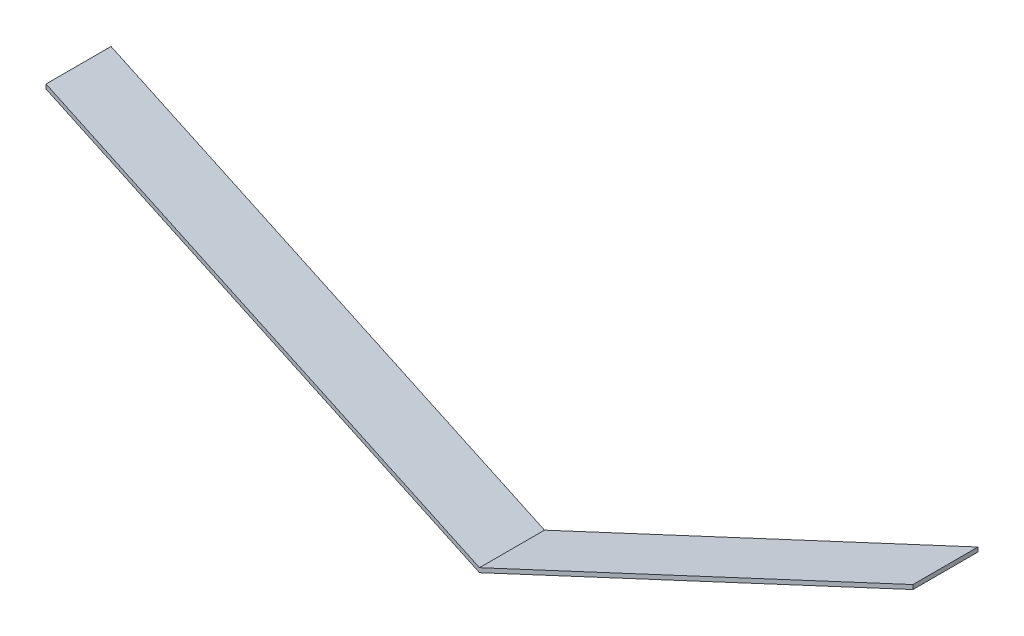
ISO-10303-21;
HEADER;
FILE_DESCRIPTION(('STEP AP214'),'2;1');
FILE_NAME('part.step','',(''),(''),'','','');
FILE_SCHEMA(('AUTOMOTIVE_DESIGN { 1 0 10303 214 1 1 1 1 }'));
ENDSEC;
DATA;
#1=APPLICATION_CONTEXT('core data for automotive mechanical design processes');
#2=APPLICATION_PROTOCOL_DEFINITION('international standard','automotive_design',2000,#1);
#3=PRODUCT_CONTEXT('',#1,'mechanical');
#4=PRODUCT('Part','Part','',(#3));
#5=PRODUCT_RELATED_PRODUCT_CATEGORY('part','',(#4));
#6=PRODUCT_DEFINITION_FORMATION('','',#4);
#7=PRODUCT_DEFINITION_CONTEXT('part definition',#1,'design');
#8=PRODUCT_DEFINITION('design','',#6,#7);
#9=PRODUCT_DEFINITION_SHAPE('','',#8);
#10=(LENGTH_UNIT() NAMED_UNIT(*) SI_UNIT(.MILLI.,.METRE.));
#11=(NAMED_UNIT(*) PLANE_ANGLE_UNIT() SI_UNIT($,.RADIAN.));
#12=(NAMED_UNIT(*) SI_UNIT($,.STERADIAN.) SOLID_ANGLE_UNIT());
#13=UNCERTAINTY_MEASURE_WITH_UNIT(LENGTH_MEASURE(1.E-05),#10,'distance_accuracy_value','');
#14=(GEOMETRIC_REPRESENTATION_CONTEXT(3) GLOBAL_UNCERTAINTY_ASSIGNED_CONTEXT((#13)) GLOBAL_UNIT_ASSIGNED_CONTEXT((#10,
#11,#12)) REPRESENTATION_CONTEXT('',''));
#15=CARTESIAN_POINT('',(0.,0.,0.));
#16=DIRECTION('',(0.,0.,1.));
#17=DIRECTION('',(1.,0.,0.));
#18=AXIS2_PLACEMENT_3D('',#15,#16,#17);
#19=CARTESIAN_POINT('',(-200.,95.2615316309993,30.));
#20=DIRECTION('',(1.,0.,0.));
#21=DIRECTION('',(0.,1.,0.));
#22=AXIS2_PLACEMENT_3D('',#19,#20,#21);
#23=PLANE('',#22);
#24=DIRECTION('',(0.,-1.,0.));
#25=VECTOR('',#24,1.);
#26=CARTESIAN_POINT('',(-200.,95.2615316309993,0.));
#27=LINE('',#26,#25);
#28=CARTESIAN_POINT('',(-200.,95.2615316309993,0.));
#29=VERTEX_POINT('',#28);
#30=CARTESIAN_POINT('',(-200.,93.2615316309993,0.));
#31=VERTEX_POINT('',#30);
#32=EDGE_CURVE('E118',#29,#31,#27,.T.);
#33=ORIENTED_EDGE('',*,*,#32,.T.);
#34=DIRECTION('',(0.,0.,-1.));
#35=VECTOR('',#34,1.);
#36=CARTESIAN_POINT('',(-200.,93.2615316309993,30.));
#37=LINE('',#36,#35);
#38=CARTESIAN_POINT('',(-200.,93.2615316309993,30.));
#39=VERTEX_POINT('',#38);
#40=EDGE_CURVE('E11',#39,#31,#37,.T.);
#41=ORIENTED_EDGE('',*,*,#40,.F.);
#42=DIRECTION('',(0.,-1.,0.));
#43=VECTOR('',#42,1.);
#44=CARTESIAN_POINT('',(-200.,95.2615316309993,30.));
#45=LINE('',#44,#43);
#46=CARTESIAN_POINT('',(-200.,95.2615316309993,30.));
#47=VERTEX_POINT('',#46);
#48=EDGE_CURVE('E130',#47,#39,#45,.T.);
#49=ORIENTED_EDGE('',*,*,#48,.F.);
#50=DIRECTION('',(0.,0.,-1.));
#51=VECTOR('',#50,1.);
#52=CARTESIAN_POINT('',(-200.,95.2615316309993,30.));
#53=LINE('',#52,#51);
#54=EDGE_CURVE('E49',#47,#29,#53,.T.);
#55=ORIENTED_EDGE('',*,*,#54,.T.);
#56=EDGE_LOOP('',(#33,#41,#49,#55));
#57=FACE_BOUND('',#56,.T.);
#58=ADVANCED_FACE('F33',(#57),#23,.F.);
#59=CARTESIAN_POINT('',(-200.,93.2615316309993,30.));
#60=DIRECTION('',(0.422618261740697,0.906307787036651,0.));
#61=DIRECTION('',(-0.906307787036651,0.422618261740697,0.));
#62=AXIS2_PLACEMENT_3D('',#59,#60,#61);
#63=PLANE('',#62);
#64=DIRECTION('',(0.906307787036651,-0.422618261740697,0.));
#65=VECTOR('',#64,1.);
#66=CARTESIAN_POINT('',(-200.,93.2615316309993,0.));
#67=LINE('',#66,#65);
#68=CARTESIAN_POINT('',(0.,0.,0.));
#69=VERTEX_POINT('',#68);
#70=EDGE_CURVE('E120',#31,#69,#67,.T.);
#71=ORIENTED_EDGE('',*,*,#70,.T.);
#72=DIRECTION('',(0.,0.,-1.));
#73=VECTOR('',#72,1.);
#74=CARTESIAN_POINT('',(0.,0.,30.));
#75=LINE('',#74,#73);
#76=CARTESIAN_POINT('',(0.,0.,30.));
#77=VERTEX_POINT('',#76);
#78=EDGE_CURVE('E41',#77,#69,#75,.T.);
#79=ORIENTED_EDGE('',*,*,#78,.F.);
#80=DIRECTION('',(0.906307787036651,-0.422618261740697,0.));
#81=VECTOR('',#80,1.);
#82=CARTESIAN_POINT('',(-200.,93.2615316309993,30.));
#83=LINE('',#82,#81);
#84=EDGE_CURVE('E81',#39,#77,#83,.T.);
#85=ORIENTED_EDGE('',*,*,#84,.F.);
#86=ORIENTED_EDGE('',*,*,#40,.T.);
#87=EDGE_LOOP('',(#71,#79,#85,#86));
#88=FACE_BOUND('',#87,.T.);
#89=ADVANCED_FACE('F150',(#88),#63,.F.);
#90=CARTESIAN_POINT('',(0.,0.,30.));
#91=DIRECTION('',(-0.422618261740704,0.906307787036648,0.));
#92=DIRECTION('',(-0.906307787036648,-0.422618261740704,0.));
#93=AXIS2_PLACEMENT_3D('',#90,#91,#92);
#94=PLANE('',#93);
#95=DIRECTION('',(0.906307787036648,0.422618261740704,0.));
#96=VECTOR('',#95,1.);
#97=CARTESIAN_POINT('',(0.,0.,0.));
#98=LINE('',#97,#96);
#99=CARTESIAN_POINT('',(200.,93.2615316310008,0.));
#100=VERTEX_POINT('',#99);
#101=EDGE_CURVE('E122',#69,#100,#98,.T.);
#102=ORIENTED_EDGE('',*,*,#101,.T.);
#103=DIRECTION('',(0.,0.,-1.));
#104=VECTOR('',#103,1.);
#105=CARTESIAN_POINT('',(200.,93.2615316310008,30.));
#106=LINE('',#105,#104);
#107=CARTESIAN_POINT('',(200.,93.2615316310008,30.));
#108=VERTEX_POINT('',#107);
#109=EDGE_CURVE('E110',#108,#100,#106,.T.);
#110=ORIENTED_EDGE('',*,*,#109,.F.);
#111=DIRECTION('',(0.906307787036648,0.422618261740704,0.));
#112=VECTOR('',#111,1.);
#113=CARTESIAN_POINT('',(0.,0.,30.));
#114=LINE('',#113,#112);
#115=EDGE_CURVE('E98',#77,#108,#114,.T.);
#116=ORIENTED_EDGE('',*,*,#115,.F.);
#117=ORIENTED_EDGE('',*,*,#78,.T.);
#118=EDGE_LOOP('',(#102,#110,#116,#117));
#119=FACE_BOUND('',#118,.T.);
#120=ADVANCED_FACE('F136',(#119),#94,.F.);
#121=CARTESIAN_POINT('',(200.,93.2615316310008,30.));
#122=DIRECTION('',(-1.,0.,0.));
#123=DIRECTION('',(0.,0.,1.));
#124=AXIS2_PLACEMENT_3D('',#121,#122,#123);
#125=PLANE('',#124);
#126=DIRECTION('',(0.,1.,0.));
#127=VECTOR('',#126,1.);
#128=CARTESIAN_POINT('',(200.,93.2615316310008,0.));
#129=LINE('',#128,#127);
#130=CARTESIAN_POINT('',(200.,95.2615316310008,0.));
#131=VERTEX_POINT('',#130);
#132=EDGE_CURVE('E107',#100,#131,#129,.T.);
#133=ORIENTED_EDGE('',*,*,#132,.T.);
#134=DIRECTION('',(0.,0.,-1.));
#135=VECTOR('',#134,1.);
#136=CARTESIAN_POINT('',(200.,95.2615316310008,30.));
#137=LINE('',#136,#135);
#138=CARTESIAN_POINT('',(200.,95.2615316310008,30.));
#139=VERTEX_POINT('',#138);
#140=EDGE_CURVE('E104',#139,#131,#137,.T.);
#141=ORIENTED_EDGE('',*,*,#140,.F.);
#142=DIRECTION('',(0.,1.,0.));
#143=VECTOR('',#142,1.);
#144=CARTESIAN_POINT('',(200.,93.2615316310008,30.));
#145=LINE('',#144,#143);
#146=EDGE_CURVE('E91',#108,#139,#145,.T.);
#147=ORIENTED_EDGE('',*,*,#146,.F.);
#148=ORIENTED_EDGE('',*,*,#109,.T.);
#149=EDGE_LOOP('',(#133,#141,#147,#148));
#150=FACE_BOUND('',#149,.T.);
#151=ADVANCED_FACE('F105',(#150),#125,.F.);
#152=CARTESIAN_POINT('',(0.,2.,30.));
#153=DIRECTION('',(-0.422618261740704,0.906307787036648,0.));
#154=DIRECTION('',(-0.906307787036648,-0.422618261740704,0.));
#155=AXIS2_PLACEMENT_3D('',#152,#153,#154);
#156=PLANE('',#155);
#157=DIRECTION('',(0.906307787036648,0.422618261740704,0.));
#158=VECTOR('',#157,1.);
#159=CARTESIAN_POINT('',(0.,2.,0.));
#160=LINE('',#159,#158);
#161=CARTESIAN_POINT('',(0.,2.,0.));
#162=VERTEX_POINT('',#161);
#163=EDGE_CURVE('E125',#162,#131,#160,.T.);
#164=ORIENTED_EDGE('',*,*,#163,.F.);
#165=DIRECTION('',(0.,0.,-1.));
#166=VECTOR('',#165,1.);
#167=CARTESIAN_POINT('',(0.,2.,30.));
#168=LINE('',#167,#166);
#169=CARTESIAN_POINT('',(0.,2.,30.));
#170=VERTEX_POINT('',#169);
#171=EDGE_CURVE('E69',#170,#162,#168,.T.);
#172=ORIENTED_EDGE('',*,*,#171,.F.);
#173=DIRECTION('',(0.906307787036648,0.422618261740704,0.));
#174=VECTOR('',#173,1.);
#175=CARTESIAN_POINT('',(0.,2.,30.));
#176=LINE('',#175,#174);
#177=EDGE_CURVE('E96',#170,#139,#176,.T.);
#178=ORIENTED_EDGE('',*,*,#177,.T.);
#179=ORIENTED_EDGE('',*,*,#140,.T.);
#180=EDGE_LOOP('',(#164,#172,#178,#179));
#181=FACE_BOUND('',#180,.T.);
#182=ADVANCED_FACE('F112',(#181),#156,.T.);
#183=CARTESIAN_POINT('',(-200.,95.2615316309993,30.));
#184=DIRECTION('',(0.422618261740697,0.906307787036651,0.));
#185=DIRECTION('',(-0.906307787036651,0.422618261740697,0.));
#186=AXIS2_PLACEMENT_3D('',#183,#184,#185);
#187=PLANE('',#186);
#188=DIRECTION('',(0.906307787036651,-0.422618261740697,0.));
#189=VECTOR('',#188,1.);
#190=CARTESIAN_POINT('',(-200.,95.2615316309993,0.));
#191=LINE('',#190,#189);
#192=EDGE_CURVE('E127',#29,#162,#191,.T.);
#193=ORIENTED_EDGE('',*,*,#192,.F.);
#194=ORIENTED_EDGE('',*,*,#54,.F.);
#195=DIRECTION('',(0.906307787036651,-0.422618261740697,0.));
#196=VECTOR('',#195,1.);
#197=CARTESIAN_POINT('',(-200.,95.2615316309993,30.));
#198=LINE('',#197,#196);
#199=EDGE_CURVE('E113',#47,#170,#198,.T.);
#200=ORIENTED_EDGE('',*,*,#199,.T.);
#201=ORIENTED_EDGE('',*,*,#171,.T.);
#202=EDGE_LOOP('',(#193,#194,#200,#201));
#203=FACE_BOUND('',#202,.T.);
#204=ADVANCED_FACE('F139',(#203),#187,.T.);
#205=CARTESIAN_POINT('',(0.,0.,30.));
#206=DIRECTION('',(0.,0.,1.));
#207=DIRECTION('',(1.,0.,0.));
#208=AXIS2_PLACEMENT_3D('',#205,#206,#207);
#209=PLANE('',#208);
#210=ORIENTED_EDGE('',*,*,#48,.T.);
#211=ORIENTED_EDGE('',*,*,#84,.T.);
#212=ORIENTED_EDGE('',*,*,#115,.T.);
#213=ORIENTED_EDGE('',*,*,#146,.T.);
#214=ORIENTED_EDGE('',*,*,#177,.F.);
#215=ORIENTED_EDGE('',*,*,#199,.F.);
#216=EDGE_LOOP('',(#210,#211,#212,#213,#214,#215));
#217=FACE_BOUND('',#216,.T.);
#218=ADVANCED_FACE('F93',(#217),#209,.T.);
#219=CARTESIAN_POINT('',(0.,0.,0.));
#220=DIRECTION('',(0.,0.,1.));
#221=DIRECTION('',(1.,0.,0.));
#222=AXIS2_PLACEMENT_3D('',#219,#220,#221);
#223=PLANE('',#222);
#224=ORIENTED_EDGE('',*,*,#32,.F.);
#225=ORIENTED_EDGE('',*,*,#192,.T.);
#226=ORIENTED_EDGE('',*,*,#163,.T.);
#227=ORIENTED_EDGE('',*,*,#132,.F.);
#228=ORIENTED_EDGE('',*,*,#101,.F.);
#229=ORIENTED_EDGE('',*,*,#70,.F.);
#230=EDGE_LOOP('',(#224,#225,#226,#227,#228,#229));
#231=FACE_BOUND('',#230,.T.);
#232=ADVANCED_FACE('F138',(#231),#223,.F.);
#233=CLOSED_SHELL('',(#58,#89,#120,#151,#182,#204,#218,#232));
#234=MANIFOLD_SOLID_BREP('B2',#233);
#235=ADVANCED_BREP_SHAPE_REPRESENTATION('',(#18,#234),#14);
#236=SHAPE_DEFINITION_REPRESENTATION(#9,#235);
ENDSEC;
END-ISO-10303-21;
